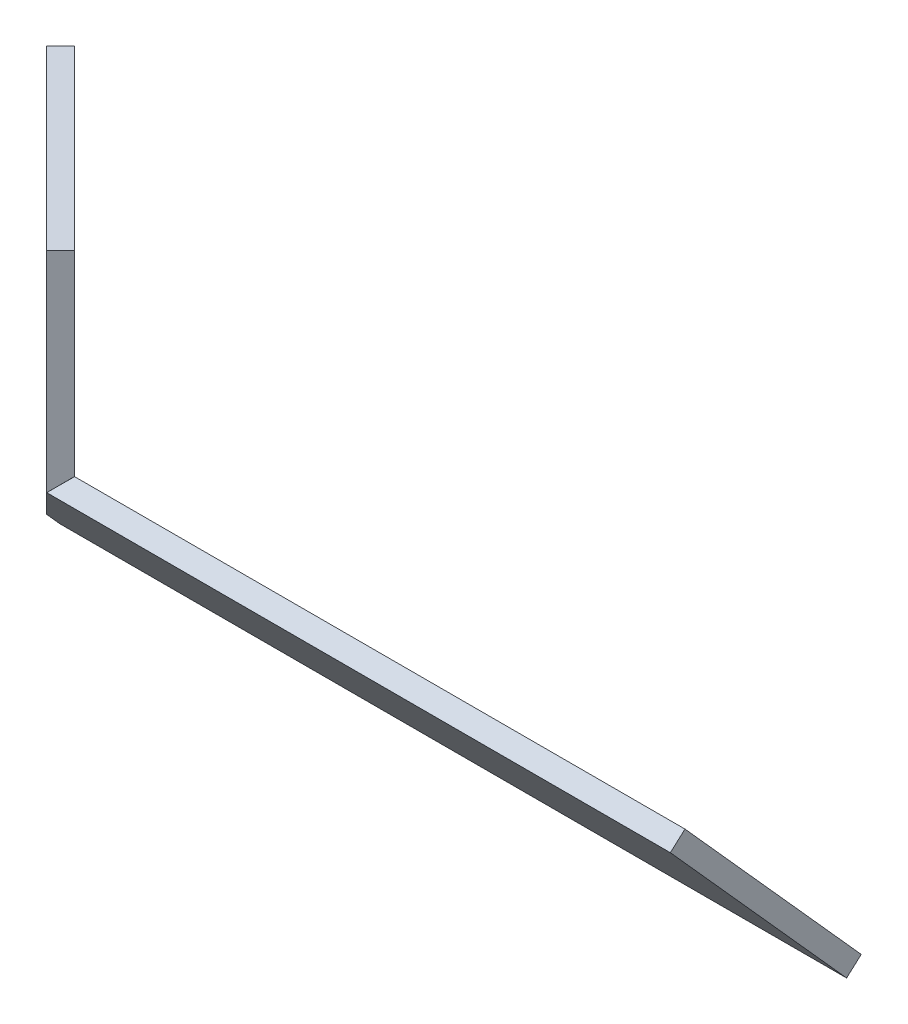
ISO-10303-21;
HEADER;
FILE_DESCRIPTION(('STEP AP214'),'2;1');
FILE_NAME('part.step','',(''),(''),'','','');
FILE_SCHEMA(('AUTOMOTIVE_DESIGN { 1 0 10303 214 1 1 1 1 }'));
ENDSEC;
DATA;
#1=APPLICATION_CONTEXT('core data for automotive mechanical design processes');
#2=APPLICATION_PROTOCOL_DEFINITION('international standard','automotive_design',2000,#1);
#3=PRODUCT_CONTEXT('',#1,'mechanical');
#4=PRODUCT('Part','Part','',(#3));
#5=PRODUCT_RELATED_PRODUCT_CATEGORY('part','',(#4));
#6=PRODUCT_DEFINITION_FORMATION('','',#4);
#7=PRODUCT_DEFINITION_CONTEXT('part definition',#1,'design');
#8=PRODUCT_DEFINITION('design','',#6,#7);
#9=PRODUCT_DEFINITION_SHAPE('','',#8);
#10=(LENGTH_UNIT() NAMED_UNIT(*) SI_UNIT(.MILLI.,.METRE.));
#11=(NAMED_UNIT(*) PLANE_ANGLE_UNIT() SI_UNIT($,.RADIAN.));
#12=(NAMED_UNIT(*) SI_UNIT($,.STERADIAN.) SOLID_ANGLE_UNIT());
#13=UNCERTAINTY_MEASURE_WITH_UNIT(LENGTH_MEASURE(1.E-05),#10,'distance_accuracy_value','');
#14=(GEOMETRIC_REPRESENTATION_CONTEXT(3) GLOBAL_UNCERTAINTY_ASSIGNED_CONTEXT((#13)) GLOBAL_UNIT_ASSIGNED_CONTEXT((#10,
#11,#12)) REPRESENTATION_CONTEXT('',''));
#15=CARTESIAN_POINT('',(0.,0.,0.));
#16=DIRECTION('',(0.,0.,1.));
#17=DIRECTION('',(1.,0.,0.));
#18=AXIS2_PLACEMENT_3D('',#15,#16,#17);
#19=CARTESIAN_POINT('',(-27.8851117745176,26.3199353551128,-1.48187513693409));
#20=DIRECTION('',(-0.726679005161556,0.685890901009333,-0.0386172936651082));
#21=DIRECTION('',(-0.686402906706854,-0.727221458473539,0.));
#22=AXIS2_PLACEMENT_3D('',#19,#20,#21);
#23=PLANE('',#22);
#24=DIRECTION('',(0.556346078123803,0.554590825824942,-0.618795650653001));
#25=VECTOR('',#24,1.);
#26=CARTESIAN_POINT('',(-7.15398269794126,47.8823579445051,-8.61357105142161));
#27=LINE('',#26,#25);
#28=CARTESIAN_POINT('',(-58.5355339059329,-3.33708627752379,48.5355339059327));
#29=VERTEX_POINT('',#28);
#30=CARTESIAN_POINT('',(-55.1878859168059,0.,44.8121140831942));
#31=VERTEX_POINT('',#30);
#32=EDGE_CURVE('E110',#29,#31,#27,.T.);
#33=ORIENTED_EDGE('',*,*,#32,.T.);
#34=DIRECTION('',(-0.555132336902642,-0.619399852316758,-0.555132336902644));
#35=VECTOR('',#34,1.);
#36=CARTESIAN_POINT('',(-38.3656177050024,18.7697774987506,61.6343822949978));
#37=LINE('',#36,#35);
#38=CARTESIAN_POINT('',(-100.,-50.,0.));
#39=VERTEX_POINT('',#38);
#40=EDGE_CURVE('E103',#31,#39,#37,.T.);
#41=ORIENTED_EDGE('',*,*,#40,.T.);
#42=DIRECTION('',(0.,-0.0562133586167888,-0.998418779026627));
#43=VECTOR('',#42,1.);
#44=CARTESIAN_POINT('',(-100.,-49.842002915651,2.80622364375801));
#45=LINE('',#44,#43);
#46=CARTESIAN_POINT('',(-100.,-49.601882016783,7.07106781186548));
#47=VERTEX_POINT('',#46);
#48=EDGE_CURVE('E105',#47,#39,#45,.T.);
#49=ORIENTED_EDGE('',*,*,#48,.F.);
#50=DIRECTION('',(0.555132336902642,0.619399852316758,0.555132336902644));
#51=VECTOR('',#50,1.);
#52=CARTESIAN_POINT('',(-40.6816146143746,16.5837762580088,66.3894531974911));
#53=LINE('',#52,#51);
#54=EDGE_CURVE('E114',#47,#29,#53,.T.);
#55=ORIENTED_EDGE('',*,*,#54,.T.);
#56=EDGE_LOOP('',(#33,#41,#49,#55));
#57=FACE_BOUND('',#56,.T.);
#58=ADVANCED_FACE('F49',(#57),#23,.T.);
#59=CARTESIAN_POINT('',(100.,-50.,0.));
#60=DIRECTION('',(0.,-0.667417255504752,0.744683964547716));
#61=DIRECTION('',(0.,-0.744683964547717,-0.667417255504752));
#62=AXIS2_PLACEMENT_3D('',#59,#60,#61);
#63=PLANE('',#62);
#64=ORIENTED_EDGE('',*,*,#40,.F.);
#65=DIRECTION('',(-1.,0.,0.));
#66=VECTOR('',#65,1.);
#67=CARTESIAN_POINT('',(100.,0.,44.8121140831942));
#68=LINE('',#67,#66);
#69=CARTESIAN_POINT('',(100.,0.,44.8121140831942));
#70=VERTEX_POINT('',#69);
#71=EDGE_CURVE('E104',#70,#31,#68,.T.);
#72=ORIENTED_EDGE('',*,*,#71,.F.);
#73=DIRECTION('',(0.,0.744683964547717,0.667417255504752));
#74=VECTOR('',#73,1.);
#75=CARTESIAN_POINT('',(100.,-50.,0.));
#76=LINE('',#75,#74);
#77=CARTESIAN_POINT('',(100.,-50.,0.));
#78=VERTEX_POINT('',#77);
#79=EDGE_CURVE('E72',#78,#70,#76,.T.);
#80=ORIENTED_EDGE('',*,*,#79,.F.);
#81=DIRECTION('',(-1.,0.,0.));
#82=VECTOR('',#81,1.);
#83=CARTESIAN_POINT('',(100.,-50.,0.));
#84=LINE('',#83,#82);
#85=EDGE_CURVE('E96',#78,#39,#84,.T.);
#86=ORIENTED_EDGE('',*,*,#85,.T.);
#87=EDGE_LOOP('',(#64,#72,#80,#86));
#88=FACE_BOUND('',#87,.T.);
#89=ADVANCED_FACE('F101',(#88),#63,.F.);
#90=CARTESIAN_POINT('',(100.,0.,44.8121140831942));
#91=DIRECTION('',(0.,-0.744683964547711,-0.667417255504758));
#92=DIRECTION('',(0.,0.667417255504758,-0.744683964547711));
#93=AXIS2_PLACEMENT_3D('',#90,#91,#92);
#94=PLANE('',#93);
#95=ORIENTED_EDGE('',*,*,#32,.F.);
#96=DIRECTION('',(-1.,0.,0.));
#97=VECTOR('',#96,1.);
#98=CARTESIAN_POINT('',(100.,-3.33708627752379,48.5355339059327));
#99=LINE('',#98,#97);
#100=CARTESIAN_POINT('',(100.,-3.33708627752379,48.5355339059327));
#101=VERTEX_POINT('',#100);
#102=EDGE_CURVE('E119',#101,#29,#99,.T.);
#103=ORIENTED_EDGE('',*,*,#102,.F.);
#104=DIRECTION('',(0.,-0.667417255504758,0.744683964547711));
#105=VECTOR('',#104,1.);
#106=CARTESIAN_POINT('',(100.,0.,44.8121140831942));
#107=LINE('',#106,#105);
#108=EDGE_CURVE('E124',#70,#101,#107,.T.);
#109=ORIENTED_EDGE('',*,*,#108,.F.);
#110=ORIENTED_EDGE('',*,*,#71,.T.);
#111=EDGE_LOOP('',(#95,#103,#109,#110));
#112=FACE_BOUND('',#111,.T.);
#113=ADVANCED_FACE('F143',(#112),#94,.F.);
#114=CARTESIAN_POINT('',(100.,0.,0.));
#115=DIRECTION('',(-1.,0.,0.));
#116=DIRECTION('',(0.,0.,1.));
#117=AXIS2_PLACEMENT_3D('',#114,#115,#116);
#118=PLANE('',#117);
#119=DIRECTION('',(0.,0.667417255504752,-0.744683964547716));
#120=VECTOR('',#119,1.);
#121=CARTESIAN_POINT('',(100.,-50.,0.));
#122=LINE('',#121,#120);
#123=CARTESIAN_POINT('',(100.,-53.3370862775237,3.72341982273856));
#124=VERTEX_POINT('',#123);
#125=EDGE_CURVE('E129',#124,#78,#122,.T.);
#126=ORIENTED_EDGE('',*,*,#125,.T.);
#127=ORIENTED_EDGE('',*,*,#79,.T.);
#128=ORIENTED_EDGE('',*,*,#108,.T.);
#129=DIRECTION('',(0.,-0.744683964547716,-0.667417255504752));
#130=VECTOR('',#129,1.);
#131=CARTESIAN_POINT('',(100.,-53.3370862775237,3.72341982273856));
#132=LINE('',#131,#130);
#133=EDGE_CURVE('E122',#101,#124,#132,.T.);
#134=ORIENTED_EDGE('',*,*,#133,.T.);
#135=EDGE_LOOP('',(#126,#127,#128,#134));
#136=FACE_BOUND('',#135,.T.);
#137=ADVANCED_FACE('F131',(#136),#118,.F.);
#138=CARTESIAN_POINT('',(100.,-50.,0.));
#139=DIRECTION('',(0.,0.744683964547716,0.667417255504752));
#140=DIRECTION('',(0.,-0.667417255504752,0.744683964547716));
#141=AXIS2_PLACEMENT_3D('',#138,#139,#140);
#142=PLANE('',#141);
#143=DIRECTION('',(-1.,0.,0.));
#144=VECTOR('',#143,1.);
#145=CARTESIAN_POINT('',(100.,-53.3370862775237,3.72341982273856));
#146=LINE('',#145,#144);
#147=CARTESIAN_POINT('',(-100.,-53.3370862775237,3.72341982273856));
#148=VERTEX_POINT('',#147);
#149=EDGE_CURVE('E97',#124,#148,#146,.T.);
#150=ORIENTED_EDGE('',*,*,#149,.T.);
#151=DIRECTION('',(0.,0.667417255504752,-0.744683964547716));
#152=VECTOR('',#151,1.);
#153=CARTESIAN_POINT('',(-100.,-50.,0.));
#154=LINE('',#153,#152);
#155=EDGE_CURVE('E12',#148,#39,#154,.T.);
#156=ORIENTED_EDGE('',*,*,#155,.T.);
#157=ORIENTED_EDGE('',*,*,#85,.F.);
#158=ORIENTED_EDGE('',*,*,#125,.F.);
#159=EDGE_LOOP('',(#150,#156,#157,#158));
#160=FACE_BOUND('',#159,.T.);
#161=ADVANCED_FACE('F94',(#160),#142,.F.);
#162=CARTESIAN_POINT('',(100.,-53.3370862775237,3.72341982273856));
#163=DIRECTION('',(0.,0.667417255504752,-0.744683964547716));
#164=DIRECTION('',(0.,0.744683964547716,0.667417255504752));
#165=AXIS2_PLACEMENT_3D('',#162,#163,#164);
#166=PLANE('',#165);
#167=ORIENTED_EDGE('',*,*,#54,.F.);
#168=DIRECTION('',(0.,-0.744683964547716,-0.667417255504752));
#169=VECTOR('',#168,1.);
#170=CARTESIAN_POINT('',(-100.,-53.3370862775237,3.72341982273856));
#171=LINE('',#170,#169);
#172=EDGE_CURVE('E53',#47,#148,#171,.T.);
#173=ORIENTED_EDGE('',*,*,#172,.T.);
#174=ORIENTED_EDGE('',*,*,#149,.F.);
#175=ORIENTED_EDGE('',*,*,#133,.F.);
#176=ORIENTED_EDGE('',*,*,#102,.T.);
#177=EDGE_LOOP('',(#167,#173,#174,#175,#176));
#178=FACE_BOUND('',#177,.T.);
#179=ADVANCED_FACE('F133',(#178),#166,.F.);
#180=CARTESIAN_POINT('',(-100.,0.,0.));
#181=DIRECTION('',(-1.,0.,0.));
#182=DIRECTION('',(0.,0.,1.));
#183=AXIS2_PLACEMENT_3D('',#180,#181,#182);
#184=PLANE('',#183);
#185=ORIENTED_EDGE('',*,*,#172,.F.);
#186=ORIENTED_EDGE('',*,*,#48,.T.);
#187=ORIENTED_EDGE('',*,*,#155,.F.);
#188=EDGE_LOOP('',(#185,#186,#187));
#189=FACE_BOUND('',#188,.T.);
#190=ADVANCED_FACE('F51',(#189),#184,.T.);
#191=CLOSED_SHELL('',(#58,#89,#113,#137,#161,#179,#190));
#192=MANIFOLD_SOLID_BREP('B2',#191);
#193=CARTESIAN_POINT('',(-27.8851117745176,26.3199353551128,-1.48187513693409));
#194=DIRECTION('',(-0.726679005161556,0.685890901009333,-0.0386172936651082));
#195=DIRECTION('',(-0.686402906706854,-0.727221458473539,0.));
#196=AXIS2_PLACEMENT_3D('',#193,#194,#195);
#197=PLANE('',#196);
#198=DIRECTION('',(-0.57674117560903,-0.578566532660014,0.576741175609028));
#199=VECTOR('',#198,1.);
#200=CARTESIAN_POINT('',(-74.1061615817271,-18.9569942131958,64.1061615817269));
#201=LINE('',#200,#199);
#202=CARTESIAN_POINT('',(-55.0000000000001,0.209637416856714,45.));
#203=VERTEX_POINT('',#202);
#204=CARTESIAN_POINT('',(-58.5355339059329,-3.33708627752381,48.5355339059327));
#205=VERTEX_POINT('',#204);
#206=EDGE_CURVE('E47',#203,#205,#201,.T.);
#207=ORIENTED_EDGE('',*,*,#206,.T.);
#208=DIRECTION('',(-0.555132336902642,-0.619399852316758,-0.555132336902644));
#209=VECTOR('',#208,1.);
#210=CARTESIAN_POINT('',(-102.315996909372,-52.1860012407417,4.7550709024932));
#211=LINE('',#210,#209);
#212=CARTESIAN_POINT('',(-100.35681016965,-50.,6.71425764221565));
#213=VERTEX_POINT('',#212);
#214=EDGE_CURVE('E200',#205,#213,#211,.T.);
#215=ORIENTED_EDGE('',*,*,#214,.T.);
#216=DIRECTION('',(-0.0530672818007096,0.,0.998590939074797));
#217=VECTOR('',#216,1.);
#218=CARTESIAN_POINT('',(-99.7183863602285,-50.,-5.29925067675175));
#219=LINE('',#218,#217);
#220=CARTESIAN_POINT('',(-100.,-50.,0.));
#221=VERTEX_POINT('',#220);
#222=EDGE_CURVE('E266',#221,#213,#219,.T.);
#223=ORIENTED_EDGE('',*,*,#222,.F.);
#224=DIRECTION('',(-0.555132336902642,-0.619399852316757,-0.555132336902644));
#225=VECTOR('',#224,1.);
#226=CARTESIAN_POINT('',(-100.,-50.,0.));
#227=LINE('',#226,#225);
#228=EDGE_CURVE('E206',#203,#221,#227,.T.);
#229=ORIENTED_EDGE('',*,*,#228,.F.);
#230=EDGE_LOOP('',(#207,#215,#223,#229));
#231=FACE_BOUND('',#230,.T.);
#232=ADVANCED_FACE('F193',(#231),#197,.F.);
#233=CARTESIAN_POINT('',(-103.535533905933,-50.,3.53553390593273));
#234=DIRECTION('',(-0.707106781186549,0.,0.707106781186546));
#235=DIRECTION('',(0.707106781186546,0.,0.707106781186549));
#236=AXIS2_PLACEMENT_3D('',#233,#234,#235);
#237=PLANE('',#236);
#238=ORIENTED_EDGE('',*,*,#214,.F.);
#239=DIRECTION('',(0.,1.,0.));
#240=VECTOR('',#239,1.);
#241=CARTESIAN_POINT('',(-58.5355339059329,-50.,48.5355339059327));
#242=LINE('',#241,#240);
#243=CARTESIAN_POINT('',(-58.5355339059329,50.,48.5355339059327));
#244=VERTEX_POINT('',#243);
#245=EDGE_CURVE('E234',#205,#244,#242,.T.);
#246=ORIENTED_EDGE('',*,*,#245,.T.);
#247=DIRECTION('',(0.707106781186546,0.,0.707106781186549));
#248=VECTOR('',#247,1.);
#249=CARTESIAN_POINT('',(-103.535533905933,50.,3.53553390593273));
#250=LINE('',#249,#248);
#251=CARTESIAN_POINT('',(-103.535533905933,50.,3.53553390593273));
#252=VERTEX_POINT('',#251);
#253=EDGE_CURVE('E238',#252,#244,#250,.T.);
#254=ORIENTED_EDGE('',*,*,#253,.F.);
#255=DIRECTION('',(0.,1.,0.));
#256=VECTOR('',#255,1.);
#257=CARTESIAN_POINT('',(-103.535533905933,-50.,3.53553390593273));
#258=LINE('',#257,#256);
#259=CARTESIAN_POINT('',(-103.535533905933,-50.,3.53553390593273));
#260=VERTEX_POINT('',#259);
#261=EDGE_CURVE('E264',#260,#252,#258,.T.);
#262=ORIENTED_EDGE('',*,*,#261,.F.);
#263=DIRECTION('',(0.707106781186546,0.,0.707106781186549));
#264=VECTOR('',#263,1.);
#265=CARTESIAN_POINT('',(-103.535533905933,-50.,3.53553390593273));
#266=LINE('',#265,#264);
#267=EDGE_CURVE('E260',#260,#213,#266,.T.);
#268=ORIENTED_EDGE('',*,*,#267,.T.);
#269=EDGE_LOOP('',(#238,#246,#254,#262,#268));
#270=FACE_BOUND('',#269,.T.);
#271=ADVANCED_FACE('F236',(#270),#237,.T.);
#272=CARTESIAN_POINT('',(-103.535533905933,-50.,3.53553390593273));
#273=DIRECTION('',(0.707106781186546,0.,0.707106781186549));
#274=DIRECTION('',(0.707106781186549,0.,-0.707106781186546));
#275=AXIS2_PLACEMENT_3D('',#272,#273,#274);
#276=PLANE('',#275);
#277=ORIENTED_EDGE('',*,*,#261,.T.);
#278=DIRECTION('',(0.707106781186549,0.,-0.707106781186546));
#279=VECTOR('',#278,1.);
#280=CARTESIAN_POINT('',(-103.535533905933,50.,3.53553390593273));
#281=LINE('',#280,#279);
#282=CARTESIAN_POINT('',(-100.,50.,0.));
#283=VERTEX_POINT('',#282);
#284=EDGE_CURVE('E255',#252,#283,#281,.T.);
#285=ORIENTED_EDGE('',*,*,#284,.T.);
#286=DIRECTION('',(0.,1.,0.));
#287=VECTOR('',#286,1.);
#288=CARTESIAN_POINT('',(-100.,-50.,0.));
#289=LINE('',#288,#287);
#290=EDGE_CURVE('E267',#221,#283,#289,.T.);
#291=ORIENTED_EDGE('',*,*,#290,.F.);
#292=DIRECTION('',(0.707106781186549,0.,-0.707106781186546));
#293=VECTOR('',#292,1.);
#294=CARTESIAN_POINT('',(-103.535533905933,-50.,3.53553390593273));
#295=LINE('',#294,#293);
#296=EDGE_CURVE('E242',#260,#221,#295,.T.);
#297=ORIENTED_EDGE('',*,*,#296,.F.);
#298=EDGE_LOOP('',(#277,#285,#291,#297));
#299=FACE_BOUND('',#298,.T.);
#300=ADVANCED_FACE('F277',(#299),#276,.F.);
#301=CARTESIAN_POINT('',(0.,-50.,0.));
#302=DIRECTION('',(0.,1.,0.));
#303=DIRECTION('',(0.,0.,1.));
#304=AXIS2_PLACEMENT_3D('',#301,#302,#303);
#305=PLANE('',#304);
#306=ORIENTED_EDGE('',*,*,#296,.T.);
#307=ORIENTED_EDGE('',*,*,#222,.T.);
#308=ORIENTED_EDGE('',*,*,#267,.F.);
#309=EDGE_LOOP('',(#306,#307,#308));
#310=FACE_BOUND('',#309,.T.);
#311=ADVANCED_FACE('F274',(#310),#305,.F.);
#312=CARTESIAN_POINT('',(0.,50.,0.));
#313=DIRECTION('',(0.,1.,0.));
#314=DIRECTION('',(0.,0.,1.));
#315=AXIS2_PLACEMENT_3D('',#312,#313,#314);
#316=PLANE('',#315);
#317=ORIENTED_EDGE('',*,*,#253,.T.);
#318=DIRECTION('',(0.707106781186549,0.,-0.707106781186546));
#319=VECTOR('',#318,1.);
#320=CARTESIAN_POINT('',(-58.5355339059329,50.,48.5355339059327));
#321=LINE('',#320,#319);
#322=CARTESIAN_POINT('',(-55.0000000000002,50.,45.));
#323=VERTEX_POINT('',#322);
#324=EDGE_CURVE('E245',#244,#323,#321,.T.);
#325=ORIENTED_EDGE('',*,*,#324,.T.);
#326=DIRECTION('',(0.707106781186546,0.,0.707106781186549));
#327=VECTOR('',#326,1.);
#328=CARTESIAN_POINT('',(-100.,50.,0.));
#329=LINE('',#328,#327);
#330=EDGE_CURVE('E251',#283,#323,#329,.T.);
#331=ORIENTED_EDGE('',*,*,#330,.F.);
#332=ORIENTED_EDGE('',*,*,#284,.F.);
#333=EDGE_LOOP('',(#317,#325,#331,#332));
#334=FACE_BOUND('',#333,.T.);
#335=ADVANCED_FACE('F253',(#334),#316,.T.);
#336=CARTESIAN_POINT('',(-100.,-50.,0.));
#337=DIRECTION('',(-0.707106781186549,0.,0.707106781186546));
#338=DIRECTION('',(0.707106781186546,0.,0.707106781186549));
#339=AXIS2_PLACEMENT_3D('',#336,#337,#338);
#340=PLANE('',#339);
#341=DIRECTION('',(0.,1.,0.));
#342=VECTOR('',#341,1.);
#343=CARTESIAN_POINT('',(-55.0000000000002,-50.,45.));
#344=LINE('',#343,#342);
#345=EDGE_CURVE('E241',#203,#323,#344,.T.);
#346=ORIENTED_EDGE('',*,*,#345,.F.);
#347=ORIENTED_EDGE('',*,*,#228,.T.);
#348=ORIENTED_EDGE('',*,*,#290,.T.);
#349=ORIENTED_EDGE('',*,*,#330,.T.);
#350=EDGE_LOOP('',(#346,#347,#348,#349));
#351=FACE_BOUND('',#350,.T.);
#352=ADVANCED_FACE('F279',(#351),#340,.F.);
#353=CARTESIAN_POINT('',(-58.5355339059329,-50.,48.5355339059327));
#354=DIRECTION('',(0.707106781186546,0.,0.707106781186549));
#355=DIRECTION('',(0.707106781186549,0.,-0.707106781186546));
#356=AXIS2_PLACEMENT_3D('',#353,#354,#355);
#357=PLANE('',#356);
#358=ORIENTED_EDGE('',*,*,#206,.F.);
#359=ORIENTED_EDGE('',*,*,#345,.T.);
#360=ORIENTED_EDGE('',*,*,#324,.F.);
#361=ORIENTED_EDGE('',*,*,#245,.F.);
#362=EDGE_LOOP('',(#358,#359,#360,#361));
#363=FACE_BOUND('',#362,.T.);
#364=ADVANCED_FACE('F246',(#363),#357,.T.);
#365=CLOSED_SHELL('',(#232,#271,#300,#311,#335,#352,#364));
#366=MANIFOLD_SOLID_BREP('B6',#365);
#367=ADVANCED_BREP_SHAPE_REPRESENTATION('',(#18,#192,#366),#14);
#368=SHAPE_DEFINITION_REPRESENTATION(#9,#367);
ENDSEC;
END-ISO-10303-21;
